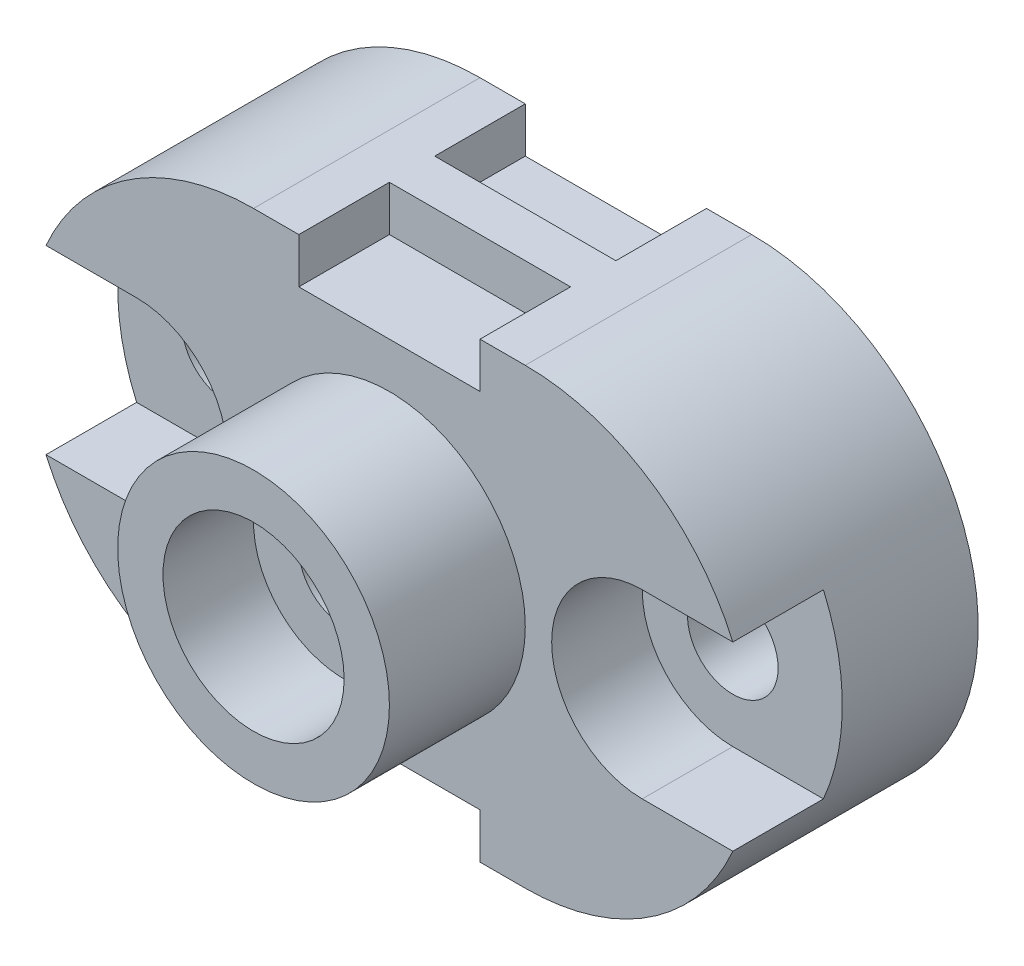
ISO-10303-21;
HEADER;
FILE_DESCRIPTION(('STEP AP214'),'2;1');
FILE_NAME('part.step','',(''),(''),'','','');
FILE_SCHEMA(('AUTOMOTIVE_DESIGN { 1 0 10303 214 1 1 1 1 }'));
ENDSEC;
DATA;
#1=APPLICATION_CONTEXT('core data for automotive mechanical design processes');
#2=APPLICATION_PROTOCOL_DEFINITION('international standard','automotive_design',2000,#1);
#3=PRODUCT_CONTEXT('',#1,'mechanical');
#4=PRODUCT('Part','Part','',(#3));
#5=PRODUCT_RELATED_PRODUCT_CATEGORY('part','',(#4));
#6=PRODUCT_DEFINITION_FORMATION('','',#4);
#7=PRODUCT_DEFINITION_CONTEXT('part definition',#1,'design');
#8=PRODUCT_DEFINITION('design','',#6,#7);
#9=PRODUCT_DEFINITION_SHAPE('','',#8);
#10=(LENGTH_UNIT() NAMED_UNIT(*) SI_UNIT(.MILLI.,.METRE.));
#11=(NAMED_UNIT(*) PLANE_ANGLE_UNIT() SI_UNIT($,.RADIAN.));
#12=(NAMED_UNIT(*) SI_UNIT($,.STERADIAN.) SOLID_ANGLE_UNIT());
#13=UNCERTAINTY_MEASURE_WITH_UNIT(LENGTH_MEASURE(1.E-05),#10,'distance_accuracy_value','');
#14=(GEOMETRIC_REPRESENTATION_CONTEXT(3) GLOBAL_UNCERTAINTY_ASSIGNED_CONTEXT((#13)) GLOBAL_UNIT_ASSIGNED_CONTEXT((#10,
#11,#12)) REPRESENTATION_CONTEXT('',''));
#15=CARTESIAN_POINT('',(0.,0.,0.));
#16=DIRECTION('',(0.,0.,1.));
#17=DIRECTION('',(1.,0.,0.));
#18=AXIS2_PLACEMENT_3D('',#15,#16,#17);
#19=CARTESIAN_POINT('',(-30.,-25.,25.));
#20=DIRECTION('',(0.,0.,1.));
#21=DIRECTION('',(1.,0.,0.));
#22=AXIS2_PLACEMENT_3D('',#19,#20,#21);
#23=PLANE('',#22);
#24=DIRECTION('',(-1.,0.,0.));
#25=VECTOR('',#24,1.);
#26=CARTESIAN_POINT('',(-52.9128784747792,-15.,25.));
#27=LINE('',#26,#25);
#28=CARTESIAN_POINT('',(-42.9128784747792,-15.,25.));
#29=VERTEX_POINT('',#28);
#30=CARTESIAN_POINT('',(-52.9128784747792,-15.,25.));
#31=VERTEX_POINT('',#30);
#32=EDGE_CURVE('E236',#29,#31,#27,.T.);
#33=ORIENTED_EDGE('',*,*,#32,.F.);
#34=CARTESIAN_POINT('',(-42.9128784747792,-25.,25.));
#35=DIRECTION('',(0.,0.,1.));
#36=DIRECTION('',(-1.,0.,0.));
#37=AXIS2_PLACEMENT_3D('',#34,#35,#36);
#38=CIRCLE('',#37,10.);
#39=CARTESIAN_POINT('',(-42.9128784747792,-35.,25.));
#40=VERTEX_POINT('',#39);
#41=EDGE_CURVE('E495',#40,#29,#38,.T.);
#42=ORIENTED_EDGE('',*,*,#41,.F.);
#43=DIRECTION('',(1.,0.,0.));
#44=VECTOR('',#43,1.);
#45=CARTESIAN_POINT('',(-52.9128784747792,-35.,25.));
#46=LINE('',#45,#44);
#47=CARTESIAN_POINT('',(-52.9128784747792,-35.,25.));
#48=VERTEX_POINT('',#47);
#49=EDGE_CURVE('E493',#48,#40,#46,.T.);
#50=ORIENTED_EDGE('',*,*,#49,.F.);
#51=CARTESIAN_POINT('',(-30.,-25.,25.));
#52=DIRECTION('',(0.,0.,1.));
#53=DIRECTION('',(1.,0.,0.));
#54=AXIS2_PLACEMENT_3D('',#51,#52,#53);
#55=CIRCLE('',#54,25.);
#56=CARTESIAN_POINT('',(-30.,-50.,25.));
#57=VERTEX_POINT('',#56);
#58=EDGE_CURVE('E240',#48,#57,#55,.T.);
#59=ORIENTED_EDGE('',*,*,#58,.T.);
#60=DIRECTION('',(1.,0.,0.));
#61=VECTOR('',#60,1.);
#62=CARTESIAN_POINT('',(-30.,-50.,25.));
#63=LINE('',#62,#61);
#64=CARTESIAN_POINT('',(-25.,-50.,25.));
#65=VERTEX_POINT('',#64);
#66=EDGE_CURVE('E412',#57,#65,#63,.T.);
#67=ORIENTED_EDGE('',*,*,#66,.T.);
#68=DIRECTION('',(0.,-1.,0.));
#69=VECTOR('',#68,1.);
#70=CARTESIAN_POINT('',(-25.,-50.,25.));
#71=LINE('',#70,#69);
#72=CARTESIAN_POINT('',(-25.,-45.,25.));
#73=VERTEX_POINT('',#72);
#74=EDGE_CURVE('E354',#73,#65,#71,.T.);
#75=ORIENTED_EDGE('',*,*,#74,.F.);
#76=DIRECTION('',(-1.,0.,0.));
#77=VECTOR('',#76,1.);
#78=CARTESIAN_POINT('',(-25.,-45.,25.));
#79=LINE('',#78,#77);
#80=CARTESIAN_POINT('',(-5.00000000000001,-45.,25.));
#81=VERTEX_POINT('',#80);
#82=EDGE_CURVE('E366',#81,#73,#79,.T.);
#83=ORIENTED_EDGE('',*,*,#82,.F.);
#84=DIRECTION('',(0.,1.,0.));
#85=VECTOR('',#84,1.);
#86=CARTESIAN_POINT('',(-5.00000000000001,-45.,25.));
#87=LINE('',#86,#85);
#88=CARTESIAN_POINT('',(-5.,-50.,25.));
#89=VERTEX_POINT('',#88);
#90=EDGE_CURVE('E344',#89,#81,#87,.T.);
#91=ORIENTED_EDGE('',*,*,#90,.F.);
#92=CARTESIAN_POINT('',(0.,-50.,25.));
#93=VERTEX_POINT('',#92);
#94=EDGE_CURVE('E411',#89,#93,#63,.T.);
#95=ORIENTED_EDGE('',*,*,#94,.T.);
#96=CARTESIAN_POINT('',(0.,-25.,25.));
#97=DIRECTION('',(0.,0.,1.));
#98=DIRECTION('',(1.,0.,0.));
#99=AXIS2_PLACEMENT_3D('',#96,#97,#98);
#100=CIRCLE('',#99,25.);
#101=CARTESIAN_POINT('',(22.9128784747793,-35.,25.));
#102=VERTEX_POINT('',#101);
#103=EDGE_CURVE('E416',#93,#102,#100,.T.);
#104=ORIENTED_EDGE('',*,*,#103,.T.);
#105=DIRECTION('',(1.,0.,0.));
#106=VECTOR('',#105,1.);
#107=CARTESIAN_POINT('',(22.9128784747793,-35.,25.));
#108=LINE('',#107,#106);
#109=CARTESIAN_POINT('',(12.9128784747793,-35.,25.));
#110=VERTEX_POINT('',#109);
#111=EDGE_CURVE('E250',#110,#102,#108,.T.);
#112=ORIENTED_EDGE('',*,*,#111,.F.);
#113=CARTESIAN_POINT('',(12.9128784747793,-25.,25.));
#114=DIRECTION('',(0.,0.,1.));
#115=DIRECTION('',(-1.,0.,0.));
#116=AXIS2_PLACEMENT_3D('',#113,#114,#115);
#117=CIRCLE('',#116,10.);
#118=CARTESIAN_POINT('',(12.9128784747793,-15.,25.));
#119=VERTEX_POINT('',#118);
#120=EDGE_CURVE('E260',#119,#110,#117,.T.);
#121=ORIENTED_EDGE('',*,*,#120,.F.);
#122=DIRECTION('',(-1.,0.,0.));
#123=VECTOR('',#122,1.);
#124=CARTESIAN_POINT('',(12.9128784747793,-15.,25.));
#125=LINE('',#124,#123);
#126=CARTESIAN_POINT('',(22.9128784747793,-15.,25.));
#127=VERTEX_POINT('',#126);
#128=EDGE_CURVE('E257',#127,#119,#125,.T.);
#129=ORIENTED_EDGE('',*,*,#128,.F.);
#130=CARTESIAN_POINT('',(0.,0.,25.));
#131=VERTEX_POINT('',#130);
#132=EDGE_CURVE('E415',#127,#131,#100,.T.);
#133=ORIENTED_EDGE('',*,*,#132,.T.);
#134=DIRECTION('',(-1.,0.,0.));
#135=VECTOR('',#134,1.);
#136=CARTESIAN_POINT('',(-30.,0.,25.));
#137=LINE('',#136,#135);
#138=CARTESIAN_POINT('',(-5.,0.,25.));
#139=VERTEX_POINT('',#138);
#140=EDGE_CURVE('E420',#131,#139,#137,.T.);
#141=ORIENTED_EDGE('',*,*,#140,.T.);
#142=DIRECTION('',(0.,1.,0.));
#143=VECTOR('',#142,1.);
#144=CARTESIAN_POINT('',(-5.,-5.,25.));
#145=LINE('',#144,#143);
#146=CARTESIAN_POINT('',(-5.,-5.,25.));
#147=VERTEX_POINT('',#146);
#148=EDGE_CURVE('E383',#147,#139,#145,.T.);
#149=ORIENTED_EDGE('',*,*,#148,.F.);
#150=DIRECTION('',(1.,0.,0.));
#151=VECTOR('',#150,1.);
#152=CARTESIAN_POINT('',(-25.,-5.,25.));
#153=LINE('',#152,#151);
#154=CARTESIAN_POINT('',(-25.,-5.,25.));
#155=VERTEX_POINT('',#154);
#156=EDGE_CURVE('E395',#155,#147,#153,.T.);
#157=ORIENTED_EDGE('',*,*,#156,.F.);
#158=DIRECTION('',(0.,-1.,0.));
#159=VECTOR('',#158,1.);
#160=CARTESIAN_POINT('',(-25.,0.,25.));
#161=LINE('',#160,#159);
#162=CARTESIAN_POINT('',(-25.,0.,25.));
#163=VERTEX_POINT('',#162);
#164=EDGE_CURVE('E373',#163,#155,#161,.T.);
#165=ORIENTED_EDGE('',*,*,#164,.F.);
#166=CARTESIAN_POINT('',(-30.,0.,25.));
#167=VERTEX_POINT('',#166);
#168=EDGE_CURVE('E419',#163,#167,#137,.T.);
#169=ORIENTED_EDGE('',*,*,#168,.T.);
#170=EDGE_CURVE('E408',#167,#31,#55,.T.);
#171=ORIENTED_EDGE('',*,*,#170,.T.);
#172=EDGE_LOOP('',(#33,#42,#50,#59,#67,#75,#83,#91,#95,#104,#112,#121,#129,#133,#141,#149,#157,
#165,#169,#171));
#173=FACE_BOUND('',#172,.T.);
#174=CARTESIAN_POINT('',(-15.,-25.,25.));
#175=DIRECTION('',(0.,0.,1.));
#176=DIRECTION('',(1.,0.,0.));
#177=AXIS2_PLACEMENT_3D('',#174,#175,#176);
#178=CIRCLE('',#177,15.);
#179=CARTESIAN_POINT('',(0.,-25.,25.));
#180=VERTEX_POINT('',#179);
#181=EDGE_CURVE('E283',#180,#180,#178,.T.);
#182=ORIENTED_EDGE('',*,*,#181,.F.);
#183=EDGE_LOOP('',(#182));
#184=FACE_BOUND('',#183,.T.);
#185=ADVANCED_FACE('F33',(#173,#184),#23,.T.);
#186=CARTESIAN_POINT('',(-30.,-25.,25.));
#187=DIRECTION('',(0.,0.,-1.));
#188=DIRECTION('',(-1.,0.,0.));
#189=AXIS2_PLACEMENT_3D('',#186,#187,#188);
#190=CYLINDRICAL_SURFACE('',#189,25.);
#191=CARTESIAN_POINT('',(-29.9999999999981,-24.9999999999999,15.));
#192=DIRECTION('',(0.,0.,1.));
#193=DIRECTION('',(-1.,0.,0.));
#194=AXIS2_PLACEMENT_3D('',#191,#192,#193);
#195=CIRCLE('',#194,25.0000000000017);
#196=CARTESIAN_POINT('',(-52.9128784747792,-15.,15.));
#197=VERTEX_POINT('',#196);
#198=CARTESIAN_POINT('',(-52.9128784747792,-35.,15.));
#199=VERTEX_POINT('',#198);
#200=EDGE_CURVE('E230',#197,#199,#195,.T.);
#201=ORIENTED_EDGE('',*,*,#200,.F.);
#202=DIRECTION('',(0.,0.,1.));
#203=VECTOR('',#202,1.);
#204=CARTESIAN_POINT('',(-52.9128784747792,-15.,15.));
#205=LINE('',#204,#203);
#206=EDGE_CURVE('E261',#197,#31,#205,.T.);
#207=ORIENTED_EDGE('',*,*,#206,.T.);
#208=ORIENTED_EDGE('',*,*,#170,.F.);
#209=DIRECTION('',(0.,0.,-1.));
#210=VECTOR('',#209,1.);
#211=CARTESIAN_POINT('',(-30.,0.,25.));
#212=LINE('',#211,#210);
#213=CARTESIAN_POINT('',(-30.,0.,0.));
#214=VERTEX_POINT('',#213);
#215=EDGE_CURVE('E423',#167,#214,#212,.T.);
#216=ORIENTED_EDGE('',*,*,#215,.T.);
#217=CARTESIAN_POINT('',(-30.,-25.,0.));
#218=DIRECTION('',(0.,0.,1.));
#219=DIRECTION('',(1.,0.,0.));
#220=AXIS2_PLACEMENT_3D('',#217,#218,#219);
#221=CIRCLE('',#220,25.);
#222=CARTESIAN_POINT('',(-30.,-50.,0.));
#223=VERTEX_POINT('',#222);
#224=EDGE_CURVE('E402',#214,#223,#221,.T.);
#225=ORIENTED_EDGE('',*,*,#224,.T.);
#226=DIRECTION('',(0.,0.,-1.));
#227=VECTOR('',#226,1.);
#228=CARTESIAN_POINT('',(-30.,-50.,25.));
#229=LINE('',#228,#227);
#230=EDGE_CURVE('E11',#57,#223,#229,.T.);
#231=ORIENTED_EDGE('',*,*,#230,.F.);
#232=ORIENTED_EDGE('',*,*,#58,.F.);
#233=DIRECTION('',(0.,0.,1.));
#234=VECTOR('',#233,1.);
#235=CARTESIAN_POINT('',(-52.9128784747792,-35.,15.));
#236=LINE('',#235,#234);
#237=EDGE_CURVE('E225',#199,#48,#236,.T.);
#238=ORIENTED_EDGE('',*,*,#237,.F.);
#239=EDGE_LOOP('',(#201,#207,#208,#216,#225,#231,#232,#238));
#240=FACE_BOUND('',#239,.T.);
#241=ADVANCED_FACE('F35',(#240),#190,.T.);
#242=CARTESIAN_POINT('',(-30.,-50.,25.));
#243=DIRECTION('',(0.,1.,0.));
#244=DIRECTION('',(0.,0.,1.));
#245=AXIS2_PLACEMENT_3D('',#242,#243,#244);
#246=PLANE('',#245);
#247=DIRECTION('',(-1.,0.,0.));
#248=VECTOR('',#247,1.);
#249=CARTESIAN_POINT('',(-25.,-50.,10.));
#250=LINE('',#249,#248);
#251=CARTESIAN_POINT('',(-5.,-50.,10.));
#252=VERTEX_POINT('',#251);
#253=CARTESIAN_POINT('',(-25.,-50.,10.));
#254=VERTEX_POINT('',#253);
#255=EDGE_CURVE('E292',#252,#254,#250,.T.);
#256=ORIENTED_EDGE('',*,*,#255,.F.);
#257=DIRECTION('',(0.,0.,-1.));
#258=VECTOR('',#257,1.);
#259=CARTESIAN_POINT('',(-5.,-50.,10.));
#260=LINE('',#259,#258);
#261=CARTESIAN_POINT('',(-5.,-50.,0.));
#262=VERTEX_POINT('',#261);
#263=EDGE_CURVE('E312',#252,#262,#260,.T.);
#264=ORIENTED_EDGE('',*,*,#263,.T.);
#265=DIRECTION('',(1.,0.,0.));
#266=VECTOR('',#265,1.);
#267=CARTESIAN_POINT('',(-30.,-50.,0.));
#268=LINE('',#267,#266);
#269=CARTESIAN_POINT('',(0.,-50.,0.));
#270=VERTEX_POINT('',#269);
#271=EDGE_CURVE('E426',#262,#270,#268,.T.);
#272=ORIENTED_EDGE('',*,*,#271,.T.);
#273=DIRECTION('',(0.,0.,-1.));
#274=VECTOR('',#273,1.);
#275=CARTESIAN_POINT('',(0.,-50.,25.));
#276=LINE('',#275,#274);
#277=EDGE_CURVE('E41',#93,#270,#276,.T.);
#278=ORIENTED_EDGE('',*,*,#277,.F.);
#279=ORIENTED_EDGE('',*,*,#94,.F.);
#280=DIRECTION('',(0.,0.,1.));
#281=VECTOR('',#280,1.);
#282=CARTESIAN_POINT('',(-5.,-50.,15.));
#283=LINE('',#282,#281);
#284=CARTESIAN_POINT('',(-5.,-50.,15.));
#285=VERTEX_POINT('',#284);
#286=EDGE_CURVE('E363',#285,#89,#283,.T.);
#287=ORIENTED_EDGE('',*,*,#286,.F.);
#288=DIRECTION('',(1.,0.,0.));
#289=VECTOR('',#288,1.);
#290=CARTESIAN_POINT('',(-5.,-50.,15.));
#291=LINE('',#290,#289);
#292=CARTESIAN_POINT('',(-25.,-50.,15.));
#293=VERTEX_POINT('',#292);
#294=EDGE_CURVE('E350',#293,#285,#291,.T.);
#295=ORIENTED_EDGE('',*,*,#294,.F.);
#296=DIRECTION('',(0.,0.,1.));
#297=VECTOR('',#296,1.);
#298=CARTESIAN_POINT('',(-25.,-50.,15.));
#299=LINE('',#298,#297);
#300=EDGE_CURVE('E370',#293,#65,#299,.T.);
#301=ORIENTED_EDGE('',*,*,#300,.T.);
#302=ORIENTED_EDGE('',*,*,#66,.F.);
#303=ORIENTED_EDGE('',*,*,#230,.T.);
#304=CARTESIAN_POINT('',(-25.,-50.,0.));
#305=VERTEX_POINT('',#304);
#306=EDGE_CURVE('E427',#223,#305,#268,.T.);
#307=ORIENTED_EDGE('',*,*,#306,.T.);
#308=DIRECTION('',(0.,0.,-1.));
#309=VECTOR('',#308,1.);
#310=CARTESIAN_POINT('',(-25.,-50.,10.));
#311=LINE('',#310,#309);
#312=EDGE_CURVE('E305',#254,#305,#311,.T.);
#313=ORIENTED_EDGE('',*,*,#312,.F.);
#314=EDGE_LOOP('',(#256,#264,#272,#278,#279,#287,#295,#301,#302,#303,#307,#313));
#315=FACE_BOUND('',#314,.T.);
#316=ADVANCED_FACE('F480',(#315),#246,.F.);
#317=CARTESIAN_POINT('',(0.,-25.,25.));
#318=DIRECTION('',(0.,0.,-1.));
#319=DIRECTION('',(-1.,0.,0.));
#320=AXIS2_PLACEMENT_3D('',#317,#318,#319);
#321=CYLINDRICAL_SURFACE('',#320,25.);
#322=CARTESIAN_POINT('',(-2.32452945780892E-13,-25.,15.));
#323=DIRECTION('',(0.,0.,1.));
#324=DIRECTION('',(1.,0.,0.));
#325=AXIS2_PLACEMENT_3D('',#322,#323,#324);
#326=CIRCLE('',#325,25.0000000000003);
#327=CARTESIAN_POINT('',(22.9128784747792,-35.,15.));
#328=VERTEX_POINT('',#327);
#329=CARTESIAN_POINT('',(22.9128784747793,-15.,15.));
#330=VERTEX_POINT('',#329);
#331=EDGE_CURVE('E247',#328,#330,#326,.T.);
#332=ORIENTED_EDGE('',*,*,#331,.F.);
#333=DIRECTION('',(0.,0.,1.));
#334=VECTOR('',#333,1.);
#335=CARTESIAN_POINT('',(22.9128784747793,-35.,15.));
#336=LINE('',#335,#334);
#337=EDGE_CURVE('E265',#328,#102,#336,.T.);
#338=ORIENTED_EDGE('',*,*,#337,.T.);
#339=ORIENTED_EDGE('',*,*,#103,.F.);
#340=ORIENTED_EDGE('',*,*,#277,.T.);
#341=CARTESIAN_POINT('',(0.,-25.,0.));
#342=DIRECTION('',(0.,0.,1.));
#343=DIRECTION('',(1.,0.,0.));
#344=AXIS2_PLACEMENT_3D('',#341,#342,#343);
#345=CIRCLE('',#344,25.);
#346=CARTESIAN_POINT('',(0.,0.,0.));
#347=VERTEX_POINT('',#346);
#348=EDGE_CURVE('E430',#270,#347,#345,.T.);
#349=ORIENTED_EDGE('',*,*,#348,.T.);
#350=DIRECTION('',(0.,0.,-1.));
#351=VECTOR('',#350,1.);
#352=CARTESIAN_POINT('',(0.,0.,25.));
#353=LINE('',#352,#351);
#354=EDGE_CURVE('E438',#131,#347,#353,.T.);
#355=ORIENTED_EDGE('',*,*,#354,.F.);
#356=ORIENTED_EDGE('',*,*,#132,.F.);
#357=DIRECTION('',(0.,0.,1.));
#358=VECTOR('',#357,1.);
#359=CARTESIAN_POINT('',(22.9128784747793,-15.,15.));
#360=LINE('',#359,#358);
#361=EDGE_CURVE('E256',#330,#127,#360,.T.);
#362=ORIENTED_EDGE('',*,*,#361,.F.);
#363=EDGE_LOOP('',(#332,#338,#339,#340,#349,#355,#356,#362));
#364=FACE_BOUND('',#363,.T.);
#365=ADVANCED_FACE('F446',(#364),#321,.T.);
#366=CARTESIAN_POINT('',(-30.,0.,25.));
#367=DIRECTION('',(0.,-1.,0.));
#368=DIRECTION('',(0.,0.,-1.));
#369=AXIS2_PLACEMENT_3D('',#366,#367,#368);
#370=PLANE('',#369);
#371=DIRECTION('',(1.,0.,0.));
#372=VECTOR('',#371,1.);
#373=CARTESIAN_POINT('',(-25.,0.,10.));
#374=LINE('',#373,#372);
#375=CARTESIAN_POINT('',(-25.,0.,10.));
#376=VERTEX_POINT('',#375);
#377=CARTESIAN_POINT('',(-5.,0.,10.));
#378=VERTEX_POINT('',#377);
#379=EDGE_CURVE('E321',#376,#378,#374,.T.);
#380=ORIENTED_EDGE('',*,*,#379,.F.);
#381=DIRECTION('',(0.,0.,-1.));
#382=VECTOR('',#381,1.);
#383=CARTESIAN_POINT('',(-25.,0.,10.));
#384=LINE('',#383,#382);
#385=CARTESIAN_POINT('',(-25.,0.,0.));
#386=VERTEX_POINT('',#385);
#387=EDGE_CURVE('E341',#376,#386,#384,.T.);
#388=ORIENTED_EDGE('',*,*,#387,.T.);
#389=DIRECTION('',(-1.,0.,0.));
#390=VECTOR('',#389,1.);
#391=CARTESIAN_POINT('',(-30.,0.,0.));
#392=LINE('',#391,#390);
#393=EDGE_CURVE('E432',#386,#214,#392,.T.);
#394=ORIENTED_EDGE('',*,*,#393,.T.);
#395=ORIENTED_EDGE('',*,*,#215,.F.);
#396=ORIENTED_EDGE('',*,*,#168,.F.);
#397=DIRECTION('',(0.,0.,1.));
#398=VECTOR('',#397,1.);
#399=CARTESIAN_POINT('',(-25.,0.,15.));
#400=LINE('',#399,#398);
#401=CARTESIAN_POINT('',(-25.,0.,15.));
#402=VERTEX_POINT('',#401);
#403=EDGE_CURVE('E392',#402,#163,#400,.T.);
#404=ORIENTED_EDGE('',*,*,#403,.F.);
#405=DIRECTION('',(-1.,0.,0.));
#406=VECTOR('',#405,1.);
#407=CARTESIAN_POINT('',(-5.,0.,15.));
#408=LINE('',#407,#406);
#409=CARTESIAN_POINT('',(-5.,0.,15.));
#410=VERTEX_POINT('',#409);
#411=EDGE_CURVE('E379',#410,#402,#408,.T.);
#412=ORIENTED_EDGE('',*,*,#411,.F.);
#413=DIRECTION('',(0.,0.,1.));
#414=VECTOR('',#413,1.);
#415=CARTESIAN_POINT('',(-5.,0.,15.));
#416=LINE('',#415,#414);
#417=EDGE_CURVE('E399',#410,#139,#416,.T.);
#418=ORIENTED_EDGE('',*,*,#417,.T.);
#419=ORIENTED_EDGE('',*,*,#140,.F.);
#420=ORIENTED_EDGE('',*,*,#354,.T.);
#421=CARTESIAN_POINT('',(-5.,0.,0.));
#422=VERTEX_POINT('',#421);
#423=EDGE_CURVE('E433',#347,#422,#392,.T.);
#424=ORIENTED_EDGE('',*,*,#423,.T.);
#425=DIRECTION('',(0.,0.,-1.));
#426=VECTOR('',#425,1.);
#427=CARTESIAN_POINT('',(-5.,0.,10.));
#428=LINE('',#427,#426);
#429=EDGE_CURVE('E334',#378,#422,#428,.T.);
#430=ORIENTED_EDGE('',*,*,#429,.F.);
#431=EDGE_LOOP('',(#380,#388,#394,#395,#396,#404,#412,#418,#419,#420,#424,#430));
#432=FACE_BOUND('',#431,.T.);
#433=ADVANCED_FACE('F460',(#432),#370,.F.);
#434=CARTESIAN_POINT('',(-30.,-25.,0.));
#435=DIRECTION('',(0.,0.,1.));
#436=DIRECTION('',(1.,0.,0.));
#437=AXIS2_PLACEMENT_3D('',#434,#435,#436);
#438=PLANE('',#437);
#439=CARTESIAN_POINT('',(12.9128784747793,-25.,0.));
#440=DIRECTION('',(0.,0.,1.));
#441=DIRECTION('',(1.,0.,0.));
#442=AXIS2_PLACEMENT_3D('',#439,#440,#441);
#443=CIRCLE('',#442,5.);
#444=CARTESIAN_POINT('',(17.9128784747793,-25.,0.));
#445=VERTEX_POINT('',#444);
#446=EDGE_CURVE('E867',#445,#445,#443,.T.);
#447=ORIENTED_EDGE('',*,*,#446,.T.);
#448=EDGE_LOOP('',(#447));
#449=FACE_BOUND('',#448,.T.);
#450=CARTESIAN_POINT('',(-42.9128784747792,-25.,0.));
#451=DIRECTION('',(0.,0.,1.));
#452=DIRECTION('',(1.,0.,0.));
#453=AXIS2_PLACEMENT_3D('',#450,#451,#452);
#454=CIRCLE('',#453,5.);
#455=CARTESIAN_POINT('',(-37.9128784747792,-25.,0.));
#456=VERTEX_POINT('',#455);
#457=EDGE_CURVE('E496',#456,#456,#454,.T.);
#458=ORIENTED_EDGE('',*,*,#457,.T.);
#459=EDGE_LOOP('',(#458));
#460=FACE_BOUND('',#459,.T.);
#461=CARTESIAN_POINT('',(-15.,-25.,0.));
#462=DIRECTION('',(0.,0.,1.));
#463=DIRECTION('',(1.,0.,0.));
#464=AXIS2_PLACEMENT_3D('',#461,#462,#463);
#465=CIRCLE('',#464,5.);
#466=CARTESIAN_POINT('',(-10.,-25.,0.));
#467=VERTEX_POINT('',#466);
#468=EDGE_CURVE('E276',#467,#467,#465,.T.);
#469=ORIENTED_EDGE('',*,*,#468,.T.);
#470=EDGE_LOOP('',(#469));
#471=FACE_BOUND('',#470,.T.);
#472=ORIENTED_EDGE('',*,*,#271,.F.);
#473=DIRECTION('',(0.,-1.,0.));
#474=VECTOR('',#473,1.);
#475=CARTESIAN_POINT('',(-5.,-50.,0.));
#476=LINE('',#475,#474);
#477=CARTESIAN_POINT('',(-5.00000000000001,-45.,0.));
#478=VERTEX_POINT('',#477);
#479=EDGE_CURVE('E296',#478,#262,#476,.T.);
#480=ORIENTED_EDGE('',*,*,#479,.F.);
#481=DIRECTION('',(1.,0.,0.));
#482=VECTOR('',#481,1.);
#483=CARTESIAN_POINT('',(-5.00000000000001,-45.,0.));
#484=LINE('',#483,#482);
#485=CARTESIAN_POINT('',(-25.,-45.,0.));
#486=VERTEX_POINT('',#485);
#487=EDGE_CURVE('E308',#486,#478,#484,.T.);
#488=ORIENTED_EDGE('',*,*,#487,.F.);
#489=DIRECTION('',(0.,1.,0.));
#490=VECTOR('',#489,1.);
#491=CARTESIAN_POINT('',(-25.,-45.,0.));
#492=LINE('',#491,#490);
#493=EDGE_CURVE('E289',#305,#486,#492,.T.);
#494=ORIENTED_EDGE('',*,*,#493,.F.);
#495=ORIENTED_EDGE('',*,*,#306,.F.);
#496=ORIENTED_EDGE('',*,*,#224,.F.);
#497=ORIENTED_EDGE('',*,*,#393,.F.);
#498=DIRECTION('',(0.,1.,0.));
#499=VECTOR('',#498,1.);
#500=CARTESIAN_POINT('',(-25.,-5.,0.));
#501=LINE('',#500,#499);
#502=CARTESIAN_POINT('',(-25.,-5.,0.));
#503=VERTEX_POINT('',#502);
#504=EDGE_CURVE('E325',#503,#386,#501,.T.);
#505=ORIENTED_EDGE('',*,*,#504,.F.);
#506=DIRECTION('',(-1.,0.,0.));
#507=VECTOR('',#506,1.);
#508=CARTESIAN_POINT('',(-5.,-5.,0.));
#509=LINE('',#508,#507);
#510=CARTESIAN_POINT('',(-5.,-5.,0.));
#511=VERTEX_POINT('',#510);
#512=EDGE_CURVE('E337',#511,#503,#509,.T.);
#513=ORIENTED_EDGE('',*,*,#512,.F.);
#514=DIRECTION('',(0.,-1.,0.));
#515=VECTOR('',#514,1.);
#516=CARTESIAN_POINT('',(-5.,0.,0.));
#517=LINE('',#516,#515);
#518=EDGE_CURVE('E315',#422,#511,#517,.T.);
#519=ORIENTED_EDGE('',*,*,#518,.F.);
#520=ORIENTED_EDGE('',*,*,#423,.F.);
#521=ORIENTED_EDGE('',*,*,#348,.F.);
#522=EDGE_LOOP('',(#472,#480,#488,#494,#495,#496,#497,#505,#513,#519,#520,#521));
#523=FACE_BOUND('',#522,.T.);
#524=ADVANCED_FACE('F453',(#449,#460,#471,#523),#438,.F.);
#525=CARTESIAN_POINT('',(-5.,-5.,15.));
#526=DIRECTION('',(1.,0.,0.));
#527=DIRECTION('',(0.,0.,-1.));
#528=AXIS2_PLACEMENT_3D('',#525,#526,#527);
#529=PLANE('',#528);
#530=ORIENTED_EDGE('',*,*,#148,.T.);
#531=ORIENTED_EDGE('',*,*,#417,.F.);
#532=DIRECTION('',(0.,1.,0.));
#533=VECTOR('',#532,1.);
#534=CARTESIAN_POINT('',(-5.,-5.,15.));
#535=LINE('',#534,#533);
#536=CARTESIAN_POINT('',(-5.,-5.,15.));
#537=VERTEX_POINT('',#536);
#538=EDGE_CURVE('E389',#537,#410,#535,.T.);
#539=ORIENTED_EDGE('',*,*,#538,.F.);
#540=DIRECTION('',(0.,0.,1.));
#541=VECTOR('',#540,1.);
#542=CARTESIAN_POINT('',(-5.,-5.,15.));
#543=LINE('',#542,#541);
#544=EDGE_CURVE('E403',#537,#147,#543,.T.);
#545=ORIENTED_EDGE('',*,*,#544,.T.);
#546=EDGE_LOOP('',(#530,#531,#539,#545));
#547=FACE_BOUND('',#546,.T.);
#548=ADVANCED_FACE('F549',(#547),#529,.F.);
#549=CARTESIAN_POINT('',(-25.,-5.,15.));
#550=DIRECTION('',(0.,-1.,0.));
#551=DIRECTION('',(0.,0.,-1.));
#552=AXIS2_PLACEMENT_3D('',#549,#550,#551);
#553=PLANE('',#552);
#554=ORIENTED_EDGE('',*,*,#156,.T.);
#555=ORIENTED_EDGE('',*,*,#544,.F.);
#556=DIRECTION('',(1.,0.,0.));
#557=VECTOR('',#556,1.);
#558=CARTESIAN_POINT('',(-25.,-5.,15.));
#559=LINE('',#558,#557);
#560=CARTESIAN_POINT('',(-25.,-5.,15.));
#561=VERTEX_POINT('',#560);
#562=EDGE_CURVE('E386',#561,#537,#559,.T.);
#563=ORIENTED_EDGE('',*,*,#562,.F.);
#564=DIRECTION('',(0.,0.,1.));
#565=VECTOR('',#564,1.);
#566=CARTESIAN_POINT('',(-25.,-5.,15.));
#567=LINE('',#566,#565);
#568=EDGE_CURVE('E405',#561,#155,#567,.T.);
#569=ORIENTED_EDGE('',*,*,#568,.T.);
#570=EDGE_LOOP('',(#554,#555,#563,#569));
#571=FACE_BOUND('',#570,.T.);
#572=ADVANCED_FACE('F582',(#571),#553,.F.);
#573=CARTESIAN_POINT('',(-25.,0.,15.));
#574=DIRECTION('',(-1.,0.,0.));
#575=DIRECTION('',(0.,0.,1.));
#576=AXIS2_PLACEMENT_3D('',#573,#574,#575);
#577=PLANE('',#576);
#578=ORIENTED_EDGE('',*,*,#164,.T.);
#579=ORIENTED_EDGE('',*,*,#568,.F.);
#580=DIRECTION('',(0.,-1.,0.));
#581=VECTOR('',#580,1.);
#582=CARTESIAN_POINT('',(-25.,0.,15.));
#583=LINE('',#582,#581);
#584=EDGE_CURVE('E382',#402,#561,#583,.T.);
#585=ORIENTED_EDGE('',*,*,#584,.F.);
#586=ORIENTED_EDGE('',*,*,#403,.T.);
#587=EDGE_LOOP('',(#578,#579,#585,#586));
#588=FACE_BOUND('',#587,.T.);
#589=ADVANCED_FACE('F545',(#588),#577,.F.);
#590=CARTESIAN_POINT('',(0.,0.,15.));
#591=DIRECTION('',(0.,0.,1.));
#592=DIRECTION('',(1.,0.,0.));
#593=AXIS2_PLACEMENT_3D('',#590,#591,#592);
#594=PLANE('',#593);
#595=ORIENTED_EDGE('',*,*,#411,.T.);
#596=ORIENTED_EDGE('',*,*,#584,.T.);
#597=ORIENTED_EDGE('',*,*,#562,.T.);
#598=ORIENTED_EDGE('',*,*,#538,.T.);
#599=EDGE_LOOP('',(#595,#596,#597,#598));
#600=FACE_BOUND('',#599,.T.);
#601=ADVANCED_FACE('F596',(#600),#594,.T.);
#602=CARTESIAN_POINT('',(-25.,-50.,15.));
#603=DIRECTION('',(-1.,0.,0.));
#604=DIRECTION('',(0.,-1.,0.));
#605=AXIS2_PLACEMENT_3D('',#602,#603,#604);
#606=PLANE('',#605);
#607=ORIENTED_EDGE('',*,*,#74,.T.);
#608=ORIENTED_EDGE('',*,*,#300,.F.);
#609=DIRECTION('',(0.,-1.,0.));
#610=VECTOR('',#609,1.);
#611=CARTESIAN_POINT('',(-25.,-50.,15.));
#612=LINE('',#611,#610);
#613=CARTESIAN_POINT('',(-25.,-45.,15.));
#614=VERTEX_POINT('',#613);
#615=EDGE_CURVE('E360',#614,#293,#612,.T.);
#616=ORIENTED_EDGE('',*,*,#615,.F.);
#617=DIRECTION('',(0.,0.,1.));
#618=VECTOR('',#617,1.);
#619=CARTESIAN_POINT('',(-25.,-45.,15.));
#620=LINE('',#619,#618);
#621=EDGE_CURVE('E374',#614,#73,#620,.T.);
#622=ORIENTED_EDGE('',*,*,#621,.T.);
#623=EDGE_LOOP('',(#607,#608,#616,#622));
#624=FACE_BOUND('',#623,.T.);
#625=ADVANCED_FACE('F489',(#624),#606,.F.);
#626=CARTESIAN_POINT('',(-25.,-45.,15.));
#627=DIRECTION('',(0.,1.,0.));
#628=DIRECTION('',(0.,0.,1.));
#629=AXIS2_PLACEMENT_3D('',#626,#627,#628);
#630=PLANE('',#629);
#631=ORIENTED_EDGE('',*,*,#82,.T.);
#632=ORIENTED_EDGE('',*,*,#621,.F.);
#633=DIRECTION('',(-1.,0.,0.));
#634=VECTOR('',#633,1.);
#635=CARTESIAN_POINT('',(-25.,-45.,15.));
#636=LINE('',#635,#634);
#637=CARTESIAN_POINT('',(-5.00000000000001,-45.,15.));
#638=VERTEX_POINT('',#637);
#639=EDGE_CURVE('E357',#638,#614,#636,.T.);
#640=ORIENTED_EDGE('',*,*,#639,.F.);
#641=DIRECTION('',(0.,0.,1.));
#642=VECTOR('',#641,1.);
#643=CARTESIAN_POINT('',(-5.00000000000001,-45.,15.));
#644=LINE('',#643,#642);
#645=EDGE_CURVE('E376',#638,#81,#644,.T.);
#646=ORIENTED_EDGE('',*,*,#645,.T.);
#647=EDGE_LOOP('',(#631,#632,#640,#646));
#648=FACE_BOUND('',#647,.T.);
#649=ADVANCED_FACE('F610',(#648),#630,.F.);
#650=CARTESIAN_POINT('',(-5.00000000000001,-45.,15.));
#651=DIRECTION('',(1.,0.,0.));
#652=DIRECTION('',(0.,1.,0.));
#653=AXIS2_PLACEMENT_3D('',#650,#651,#652);
#654=PLANE('',#653);
#655=ORIENTED_EDGE('',*,*,#90,.T.);
#656=ORIENTED_EDGE('',*,*,#645,.F.);
#657=DIRECTION('',(0.,1.,0.));
#658=VECTOR('',#657,1.);
#659=CARTESIAN_POINT('',(-5.00000000000001,-45.,15.));
#660=LINE('',#659,#658);
#661=EDGE_CURVE('E353',#285,#638,#660,.T.);
#662=ORIENTED_EDGE('',*,*,#661,.F.);
#663=ORIENTED_EDGE('',*,*,#286,.T.);
#664=EDGE_LOOP('',(#655,#656,#662,#663));
#665=FACE_BOUND('',#664,.T.);
#666=ADVANCED_FACE('F483',(#665),#654,.F.);
#667=CARTESIAN_POINT('',(0.,0.,15.));
#668=DIRECTION('',(0.,0.,-1.));
#669=DIRECTION('',(-1.,0.,0.));
#670=AXIS2_PLACEMENT_3D('',#667,#668,#669);
#671=PLANE('',#670);
#672=ORIENTED_EDGE('',*,*,#294,.T.);
#673=ORIENTED_EDGE('',*,*,#661,.T.);
#674=ORIENTED_EDGE('',*,*,#639,.T.);
#675=ORIENTED_EDGE('',*,*,#615,.T.);
#676=EDGE_LOOP('',(#672,#673,#674,#675));
#677=FACE_BOUND('',#676,.T.);
#678=ADVANCED_FACE('F486',(#677),#671,.F.);
#679=CARTESIAN_POINT('',(-25.,-5.,10.));
#680=DIRECTION('',(-1.,0.,0.));
#681=DIRECTION('',(0.,0.,1.));
#682=AXIS2_PLACEMENT_3D('',#679,#680,#681);
#683=PLANE('',#682);
#684=ORIENTED_EDGE('',*,*,#504,.T.);
#685=ORIENTED_EDGE('',*,*,#387,.F.);
#686=DIRECTION('',(0.,1.,0.));
#687=VECTOR('',#686,1.);
#688=CARTESIAN_POINT('',(-25.,-5.,10.));
#689=LINE('',#688,#687);
#690=CARTESIAN_POINT('',(-25.,-5.,10.));
#691=VERTEX_POINT('',#690);
#692=EDGE_CURVE('E331',#691,#376,#689,.T.);
#693=ORIENTED_EDGE('',*,*,#692,.F.);
#694=DIRECTION('',(0.,0.,-1.));
#695=VECTOR('',#694,1.);
#696=CARTESIAN_POINT('',(-25.,-5.,10.));
#697=LINE('',#696,#695);
#698=EDGE_CURVE('E345',#691,#503,#697,.T.);
#699=ORIENTED_EDGE('',*,*,#698,.T.);
#700=EDGE_LOOP('',(#684,#685,#693,#699));
#701=FACE_BOUND('',#700,.T.);
#702=ADVANCED_FACE('F629',(#701),#683,.F.);
#703=CARTESIAN_POINT('',(-5.,-5.,10.));
#704=DIRECTION('',(0.,-1.,0.));
#705=DIRECTION('',(0.,0.,-1.));
#706=AXIS2_PLACEMENT_3D('',#703,#704,#705);
#707=PLANE('',#706);
#708=ORIENTED_EDGE('',*,*,#512,.T.);
#709=ORIENTED_EDGE('',*,*,#698,.F.);
#710=DIRECTION('',(-1.,0.,0.));
#711=VECTOR('',#710,1.);
#712=CARTESIAN_POINT('',(-5.,-5.,10.));
#713=LINE('',#712,#711);
#714=CARTESIAN_POINT('',(-5.,-5.,10.));
#715=VERTEX_POINT('',#714);
#716=EDGE_CURVE('E328',#715,#691,#713,.T.);
#717=ORIENTED_EDGE('',*,*,#716,.F.);
#718=DIRECTION('',(0.,0.,-1.));
#719=VECTOR('',#718,1.);
#720=CARTESIAN_POINT('',(-5.,-5.,10.));
#721=LINE('',#720,#719);
#722=EDGE_CURVE('E347',#715,#511,#721,.T.);
#723=ORIENTED_EDGE('',*,*,#722,.T.);
#724=EDGE_LOOP('',(#708,#709,#717,#723));
#725=FACE_BOUND('',#724,.T.);
#726=ADVANCED_FACE('F635',(#725),#707,.F.);
#727=CARTESIAN_POINT('',(-5.,0.,10.));
#728=DIRECTION('',(1.,0.,0.));
#729=DIRECTION('',(0.,1.,0.));
#730=AXIS2_PLACEMENT_3D('',#727,#728,#729);
#731=PLANE('',#730);
#732=ORIENTED_EDGE('',*,*,#518,.T.);
#733=ORIENTED_EDGE('',*,*,#722,.F.);
#734=DIRECTION('',(0.,-1.,0.));
#735=VECTOR('',#734,1.);
#736=CARTESIAN_POINT('',(-5.,0.,10.));
#737=LINE('',#736,#735);
#738=EDGE_CURVE('E324',#378,#715,#737,.T.);
#739=ORIENTED_EDGE('',*,*,#738,.F.);
#740=ORIENTED_EDGE('',*,*,#429,.T.);
#741=EDGE_LOOP('',(#732,#733,#739,#740));
#742=FACE_BOUND('',#741,.T.);
#743=ADVANCED_FACE('F643',(#742),#731,.F.);
#744=CARTESIAN_POINT('',(0.,0.,10.));
#745=DIRECTION('',(0.,0.,-1.));
#746=DIRECTION('',(-1.,0.,0.));
#747=AXIS2_PLACEMENT_3D('',#744,#745,#746);
#748=PLANE('',#747);
#749=ORIENTED_EDGE('',*,*,#379,.T.);
#750=ORIENTED_EDGE('',*,*,#738,.T.);
#751=ORIENTED_EDGE('',*,*,#716,.T.);
#752=ORIENTED_EDGE('',*,*,#692,.T.);
#753=EDGE_LOOP('',(#749,#750,#751,#752));
#754=FACE_BOUND('',#753,.T.);
#755=ADVANCED_FACE('F536',(#754),#748,.T.);
#756=CARTESIAN_POINT('',(-5.,-50.,10.));
#757=DIRECTION('',(1.,0.,0.));
#758=DIRECTION('',(0.,1.,0.));
#759=AXIS2_PLACEMENT_3D('',#756,#757,#758);
#760=PLANE('',#759);
#761=ORIENTED_EDGE('',*,*,#479,.T.);
#762=ORIENTED_EDGE('',*,*,#263,.F.);
#763=DIRECTION('',(0.,-1.,0.));
#764=VECTOR('',#763,1.);
#765=CARTESIAN_POINT('',(-5.,-50.,10.));
#766=LINE('',#765,#764);
#767=CARTESIAN_POINT('',(-5.00000000000001,-45.,10.));
#768=VERTEX_POINT('',#767);
#769=EDGE_CURVE('E302',#768,#252,#766,.T.);
#770=ORIENTED_EDGE('',*,*,#769,.F.);
#771=DIRECTION('',(0.,0.,-1.));
#772=VECTOR('',#771,1.);
#773=CARTESIAN_POINT('',(-5.00000000000001,-45.,10.));
#774=LINE('',#773,#772);
#775=EDGE_CURVE('E316',#768,#478,#774,.T.);
#776=ORIENTED_EDGE('',*,*,#775,.T.);
#777=EDGE_LOOP('',(#761,#762,#770,#776));
#778=FACE_BOUND('',#777,.T.);
#779=ADVANCED_FACE('F526',(#778),#760,.F.);
#780=CARTESIAN_POINT('',(-5.00000000000001,-45.,10.));
#781=DIRECTION('',(0.,1.,0.));
#782=DIRECTION('',(0.,0.,1.));
#783=AXIS2_PLACEMENT_3D('',#780,#781,#782);
#784=PLANE('',#783);
#785=ORIENTED_EDGE('',*,*,#487,.T.);
#786=ORIENTED_EDGE('',*,*,#775,.F.);
#787=DIRECTION('',(1.,0.,0.));
#788=VECTOR('',#787,1.);
#789=CARTESIAN_POINT('',(-5.00000000000001,-45.,10.));
#790=LINE('',#789,#788);
#791=CARTESIAN_POINT('',(-25.,-45.,10.));
#792=VERTEX_POINT('',#791);
#793=EDGE_CURVE('E299',#792,#768,#790,.T.);
#794=ORIENTED_EDGE('',*,*,#793,.F.);
#795=DIRECTION('',(0.,0.,-1.));
#796=VECTOR('',#795,1.);
#797=CARTESIAN_POINT('',(-25.,-45.,10.));
#798=LINE('',#797,#796);
#799=EDGE_CURVE('E318',#792,#486,#798,.T.);
#800=ORIENTED_EDGE('',*,*,#799,.T.);
#801=EDGE_LOOP('',(#785,#786,#794,#800));
#802=FACE_BOUND('',#801,.T.);
#803=ADVANCED_FACE('F528',(#802),#784,.F.);
#804=CARTESIAN_POINT('',(-25.,-45.,10.));
#805=DIRECTION('',(-1.,0.,0.));
#806=DIRECTION('',(0.,-1.,0.));
#807=AXIS2_PLACEMENT_3D('',#804,#805,#806);
#808=PLANE('',#807);
#809=ORIENTED_EDGE('',*,*,#493,.T.);
#810=ORIENTED_EDGE('',*,*,#799,.F.);
#811=DIRECTION('',(0.,1.,0.));
#812=VECTOR('',#811,1.);
#813=CARTESIAN_POINT('',(-25.,-45.,10.));
#814=LINE('',#813,#812);
#815=EDGE_CURVE('E295',#254,#792,#814,.T.);
#816=ORIENTED_EDGE('',*,*,#815,.F.);
#817=ORIENTED_EDGE('',*,*,#312,.T.);
#818=EDGE_LOOP('',(#809,#810,#816,#817));
#819=FACE_BOUND('',#818,.T.);
#820=ADVANCED_FACE('F520',(#819),#808,.F.);
#821=CARTESIAN_POINT('',(0.,0.,10.));
#822=DIRECTION('',(0.,0.,1.));
#823=DIRECTION('',(1.,0.,0.));
#824=AXIS2_PLACEMENT_3D('',#821,#822,#823);
#825=PLANE('',#824);
#826=ORIENTED_EDGE('',*,*,#255,.T.);
#827=ORIENTED_EDGE('',*,*,#815,.T.);
#828=ORIENTED_EDGE('',*,*,#793,.T.);
#829=ORIENTED_EDGE('',*,*,#769,.T.);
#830=EDGE_LOOP('',(#826,#827,#828,#829));
#831=FACE_BOUND('',#830,.T.);
#832=ADVANCED_FACE('F523',(#831),#825,.F.);
#833=CARTESIAN_POINT('',(-15.,-25.,40.));
#834=DIRECTION('',(0.,0.,-1.));
#835=DIRECTION('',(-1.,0.,0.));
#836=AXIS2_PLACEMENT_3D('',#833,#834,#835);
#837=CYLINDRICAL_SURFACE('',#836,15.);
#838=CARTESIAN_POINT('',(-15.,-25.,40.));
#839=DIRECTION('',(0.,0.,1.));
#840=DIRECTION('',(1.,0.,0.));
#841=AXIS2_PLACEMENT_3D('',#838,#839,#840);
#842=CIRCLE('',#841,15.);
#843=CARTESIAN_POINT('',(0.,-25.,40.));
#844=VERTEX_POINT('',#843);
#845=EDGE_CURVE('E286',#844,#844,#842,.T.);
#846=ORIENTED_EDGE('',*,*,#845,.F.);
#847=EDGE_LOOP('',(#846));
#848=FACE_BOUND('',#847,.T.);
#849=ORIENTED_EDGE('',*,*,#181,.T.);
#850=EDGE_LOOP('',(#849));
#851=FACE_BOUND('',#850,.T.);
#852=ADVANCED_FACE('F682',(#848,#851),#837,.T.);
#853=CARTESIAN_POINT('',(-15.,-25.,40.));
#854=DIRECTION('',(0.,0.,1.));
#855=DIRECTION('',(1.,0.,0.));
#856=AXIS2_PLACEMENT_3D('',#853,#854,#855);
#857=PLANE('',#856);
#858=CARTESIAN_POINT('',(-15.,-25.,40.));
#859=DIRECTION('',(0.,0.,1.));
#860=DIRECTION('',(1.,0.,0.));
#861=AXIS2_PLACEMENT_3D('',#858,#859,#860);
#862=CIRCLE('',#861,10.);
#863=CARTESIAN_POINT('',(-5.00000000000001,-25.,40.));
#864=VERTEX_POINT('',#863);
#865=EDGE_CURVE('E279',#864,#864,#862,.T.);
#866=ORIENTED_EDGE('',*,*,#865,.F.);
#867=EDGE_LOOP('',(#866));
#868=FACE_BOUND('',#867,.T.);
#869=ORIENTED_EDGE('',*,*,#845,.T.);
#870=EDGE_LOOP('',(#869));
#871=FACE_BOUND('',#870,.T.);
#872=ADVANCED_FACE('F692',(#868,#871),#857,.T.);
#873=CARTESIAN_POINT('',(-15.,-25.,30.));
#874=DIRECTION('',(0.,0.,1.));
#875=DIRECTION('',(1.,0.,0.));
#876=AXIS2_PLACEMENT_3D('',#873,#874,#875);
#877=CYLINDRICAL_SURFACE('',#876,10.);
#878=CARTESIAN_POINT('',(-15.,-25.,30.));
#879=DIRECTION('',(0.,0.,1.));
#880=DIRECTION('',(1.,0.,0.));
#881=AXIS2_PLACEMENT_3D('',#878,#879,#880);
#882=CIRCLE('',#881,10.);
#883=CARTESIAN_POINT('',(-5.00000000000001,-25.,30.));
#884=VERTEX_POINT('',#883);
#885=EDGE_CURVE('E280',#884,#884,#882,.T.);
#886=ORIENTED_EDGE('',*,*,#885,.F.);
#887=EDGE_LOOP('',(#886));
#888=FACE_BOUND('',#887,.T.);
#889=ORIENTED_EDGE('',*,*,#865,.T.);
#890=EDGE_LOOP('',(#889));
#891=FACE_BOUND('',#890,.T.);
#892=ADVANCED_FACE('F702',(#888,#891),#877,.F.);
#893=CARTESIAN_POINT('',(-15.,-25.,30.));
#894=DIRECTION('',(0.,0.,1.));
#895=DIRECTION('',(1.,0.,0.));
#896=AXIS2_PLACEMENT_3D('',#893,#894,#895);
#897=PLANE('',#896);
#898=CARTESIAN_POINT('',(-15.,-25.,30.));
#899=DIRECTION('',(0.,0.,1.));
#900=DIRECTION('',(1.,0.,0.));
#901=AXIS2_PLACEMENT_3D('',#898,#899,#900);
#902=CIRCLE('',#901,5.);
#903=CARTESIAN_POINT('',(-10.,-25.,30.));
#904=VERTEX_POINT('',#903);
#905=EDGE_CURVE('E268',#904,#904,#902,.T.);
#906=ORIENTED_EDGE('',*,*,#905,.F.);
#907=EDGE_LOOP('',(#906));
#908=FACE_BOUND('',#907,.T.);
#909=ORIENTED_EDGE('',*,*,#885,.T.);
#910=EDGE_LOOP('',(#909));
#911=FACE_BOUND('',#910,.T.);
#912=ADVANCED_FACE('F712',(#908,#911),#897,.T.);
#913=CARTESIAN_POINT('',(-15.,-25.,-270.));
#914=DIRECTION('',(0.,0.,1.));
#915=DIRECTION('',(1.,0.,0.));
#916=AXIS2_PLACEMENT_3D('',#913,#914,#915);
#917=CYLINDRICAL_SURFACE('',#916,5.);
#918=ORIENTED_EDGE('',*,*,#905,.T.);
#919=EDGE_LOOP('',(#918));
#920=FACE_BOUND('',#919,.T.);
#921=ORIENTED_EDGE('',*,*,#468,.F.);
#922=EDGE_LOOP('',(#921));
#923=FACE_BOUND('',#922,.T.);
#924=ADVANCED_FACE('F722',(#920,#923),#917,.F.);
#925=CARTESIAN_POINT('',(22.9128784747793,-35.,15.));
#926=DIRECTION('',(0.,-1.,0.));
#927=DIRECTION('',(0.,0.,-1.));
#928=AXIS2_PLACEMENT_3D('',#925,#926,#927);
#929=PLANE('',#928);
#930=ORIENTED_EDGE('',*,*,#111,.T.);
#931=ORIENTED_EDGE('',*,*,#337,.F.);
#932=DIRECTION('',(1.,0.,0.));
#933=VECTOR('',#932,1.);
#934=CARTESIAN_POINT('',(22.9128784747793,-35.,15.));
#935=LINE('',#934,#933);
#936=CARTESIAN_POINT('',(12.9128784747793,-35.,15.));
#937=VERTEX_POINT('',#936);
#938=EDGE_CURVE('E56',#937,#328,#935,.T.);
#939=ORIENTED_EDGE('',*,*,#938,.F.);
#940=DIRECTION('',(0.,0.,1.));
#941=VECTOR('',#940,1.);
#942=CARTESIAN_POINT('',(12.9128784747793,-35.,15.));
#943=LINE('',#942,#941);
#944=EDGE_CURVE('E269',#937,#110,#943,.T.);
#945=ORIENTED_EDGE('',*,*,#944,.T.);
#946=EDGE_LOOP('',(#930,#931,#939,#945));
#947=FACE_BOUND('',#946,.T.);
#948=ADVANCED_FACE('F731',(#947),#929,.F.);
#949=CARTESIAN_POINT('',(12.9128784747793,-25.,15.));
#950=DIRECTION('',(0.,0.,1.));
#951=DIRECTION('',(1.,0.,0.));
#952=AXIS2_PLACEMENT_3D('',#949,#950,#951);
#953=CYLINDRICAL_SURFACE('',#952,10.);
#954=ORIENTED_EDGE('',*,*,#120,.T.);
#955=ORIENTED_EDGE('',*,*,#944,.F.);
#956=CARTESIAN_POINT('',(12.9128784747793,-25.,15.));
#957=DIRECTION('',(0.,0.,1.));
#958=DIRECTION('',(-1.,0.,0.));
#959=AXIS2_PLACEMENT_3D('',#956,#957,#958);
#960=CIRCLE('',#959,10.);
#961=CARTESIAN_POINT('',(12.9128784747793,-15.,15.));
#962=VERTEX_POINT('',#961);
#963=EDGE_CURVE('E253',#962,#937,#960,.T.);
#964=ORIENTED_EDGE('',*,*,#963,.F.);
#965=DIRECTION('',(0.,0.,1.));
#966=VECTOR('',#965,1.);
#967=CARTESIAN_POINT('',(12.9128784747793,-15.,15.));
#968=LINE('',#967,#966);
#969=EDGE_CURVE('E271',#962,#119,#968,.T.);
#970=ORIENTED_EDGE('',*,*,#969,.T.);
#971=EDGE_LOOP('',(#954,#955,#964,#970));
#972=FACE_BOUND('',#971,.T.);
#973=ADVANCED_FACE('F780',(#972),#953,.F.);
#974=CARTESIAN_POINT('',(12.9128784747793,-15.,15.));
#975=DIRECTION('',(0.,1.,0.));
#976=DIRECTION('',(-1.,0.,0.));
#977=AXIS2_PLACEMENT_3D('',#974,#975,#976);
#978=PLANE('',#977);
#979=ORIENTED_EDGE('',*,*,#128,.T.);
#980=ORIENTED_EDGE('',*,*,#969,.F.);
#981=DIRECTION('',(-1.,0.,0.));
#982=VECTOR('',#981,1.);
#983=CARTESIAN_POINT('',(12.9128784747793,-15.,15.));
#984=LINE('',#983,#982);
#985=EDGE_CURVE('E249',#330,#962,#984,.T.);
#986=ORIENTED_EDGE('',*,*,#985,.F.);
#987=ORIENTED_EDGE('',*,*,#361,.T.);
#988=EDGE_LOOP('',(#979,#980,#986,#987));
#989=FACE_BOUND('',#988,.T.);
#990=ADVANCED_FACE('F472',(#989),#978,.F.);
#991=CARTESIAN_POINT('',(-2.32452945780892E-13,-25.,15.));
#992=DIRECTION('',(0.,0.,1.));
#993=DIRECTION('',(1.,0.,0.));
#994=AXIS2_PLACEMENT_3D('',#991,#992,#993);
#995=PLANE('',#994);
#996=CARTESIAN_POINT('',(12.9128784747793,-25.,15.));
#997=DIRECTION('',(0.,0.,1.));
#998=DIRECTION('',(1.,0.,0.));
#999=AXIS2_PLACEMENT_3D('',#996,#997,#998);
#1000=CIRCLE('',#999,5.);
#1001=CARTESIAN_POINT('',(17.9128784747793,-25.,15.));
#1002=VERTEX_POINT('',#1001);
#1003=EDGE_CURVE('E864',#1002,#1002,#1000,.T.);
#1004=ORIENTED_EDGE('',*,*,#1003,.F.);
#1005=EDGE_LOOP('',(#1004));
#1006=FACE_BOUND('',#1005,.T.);
#1007=ORIENTED_EDGE('',*,*,#331,.T.);
#1008=ORIENTED_EDGE('',*,*,#985,.T.);
#1009=ORIENTED_EDGE('',*,*,#963,.T.);
#1010=ORIENTED_EDGE('',*,*,#938,.T.);
#1011=EDGE_LOOP('',(#1007,#1008,#1009,#1010));
#1012=FACE_BOUND('',#1011,.T.);
#1013=ADVANCED_FACE('F474',(#1006,#1012),#995,.T.);
#1014=CARTESIAN_POINT('',(-52.9128784747792,-15.,15.));
#1015=DIRECTION('',(0.,1.,0.));
#1016=DIRECTION('',(0.,0.,1.));
#1017=AXIS2_PLACEMENT_3D('',#1014,#1015,#1016);
#1018=PLANE('',#1017);
#1019=ORIENTED_EDGE('',*,*,#32,.T.);
#1020=ORIENTED_EDGE('',*,*,#206,.F.);
#1021=DIRECTION('',(-1.,0.,0.));
#1022=VECTOR('',#1021,1.);
#1023=CARTESIAN_POINT('',(-52.9128784747792,-15.,15.));
#1024=LINE('',#1023,#1022);
#1025=CARTESIAN_POINT('',(-42.9128784747792,-15.,15.));
#1026=VERTEX_POINT('',#1025);
#1027=EDGE_CURVE('E48',#1026,#197,#1024,.T.);
#1028=ORIENTED_EDGE('',*,*,#1027,.F.);
#1029=DIRECTION('',(0.,0.,1.));
#1030=VECTOR('',#1029,1.);
#1031=CARTESIAN_POINT('',(-42.9128784747792,-15.,15.));
#1032=LINE('',#1031,#1030);
#1033=EDGE_CURVE('E242',#1026,#29,#1032,.T.);
#1034=ORIENTED_EDGE('',*,*,#1033,.T.);
#1035=EDGE_LOOP('',(#1019,#1020,#1028,#1034));
#1036=FACE_BOUND('',#1035,.T.);
#1037=ADVANCED_FACE('F506',(#1036),#1018,.F.);
#1038=CARTESIAN_POINT('',(-42.9128784747792,-25.,15.));
#1039=DIRECTION('',(0.,0.,1.));
#1040=DIRECTION('',(1.,0.,0.));
#1041=AXIS2_PLACEMENT_3D('',#1038,#1039,#1040);
#1042=CYLINDRICAL_SURFACE('',#1041,10.);
#1043=ORIENTED_EDGE('',*,*,#41,.T.);
#1044=ORIENTED_EDGE('',*,*,#1033,.F.);
#1045=CARTESIAN_POINT('',(-42.9128784747792,-25.,15.));
#1046=DIRECTION('',(0.,0.,1.));
#1047=DIRECTION('',(-1.,0.,0.));
#1048=AXIS2_PLACEMENT_3D('',#1045,#1046,#1047);
#1049=CIRCLE('',#1048,10.);
#1050=CARTESIAN_POINT('',(-42.9128784747792,-35.,15.));
#1051=VERTEX_POINT('',#1050);
#1052=EDGE_CURVE('E229',#1051,#1026,#1049,.T.);
#1053=ORIENTED_EDGE('',*,*,#1052,.F.);
#1054=DIRECTION('',(0.,0.,1.));
#1055=VECTOR('',#1054,1.);
#1056=CARTESIAN_POINT('',(-42.9128784747792,-35.,15.));
#1057=LINE('',#1056,#1055);
#1058=EDGE_CURVE('E227',#1051,#40,#1057,.T.);
#1059=ORIENTED_EDGE('',*,*,#1058,.T.);
#1060=EDGE_LOOP('',(#1043,#1044,#1053,#1059));
#1061=FACE_BOUND('',#1060,.T.);
#1062=ADVANCED_FACE('F508',(#1061),#1042,.F.);
#1063=CARTESIAN_POINT('',(-52.9128784747792,-35.,15.));
#1064=DIRECTION('',(0.,-1.,0.));
#1065=DIRECTION('',(0.,0.,-1.));
#1066=AXIS2_PLACEMENT_3D('',#1063,#1064,#1065);
#1067=PLANE('',#1066);
#1068=ORIENTED_EDGE('',*,*,#49,.T.);
#1069=ORIENTED_EDGE('',*,*,#1058,.F.);
#1070=DIRECTION('',(1.,0.,0.));
#1071=VECTOR('',#1070,1.);
#1072=CARTESIAN_POINT('',(-52.9128784747792,-35.,15.));
#1073=LINE('',#1072,#1071);
#1074=EDGE_CURVE('E221',#199,#1051,#1073,.T.);
#1075=ORIENTED_EDGE('',*,*,#1074,.F.);
#1076=ORIENTED_EDGE('',*,*,#237,.T.);
#1077=EDGE_LOOP('',(#1068,#1069,#1075,#1076));
#1078=FACE_BOUND('',#1077,.T.);
#1079=ADVANCED_FACE('F223',(#1078),#1067,.F.);
#1080=CARTESIAN_POINT('',(-29.9999999999981,-24.9999999999999,15.));
#1081=DIRECTION('',(0.,0.,-1.));
#1082=DIRECTION('',(-1.,0.,0.));
#1083=AXIS2_PLACEMENT_3D('',#1080,#1081,#1082);
#1084=PLANE('',#1083);
#1085=CARTESIAN_POINT('',(-42.9128784747792,-25.,15.));
#1086=DIRECTION('',(0.,0.,1.));
#1087=DIRECTION('',(1.,0.,0.));
#1088=AXIS2_PLACEMENT_3D('',#1085,#1086,#1087);
#1089=CIRCLE('',#1088,5.);
#1090=CARTESIAN_POINT('',(-37.9128784747792,-25.,15.));
#1091=VERTEX_POINT('',#1090);
#1092=EDGE_CURVE('E500',#1091,#1091,#1089,.T.);
#1093=ORIENTED_EDGE('',*,*,#1092,.F.);
#1094=EDGE_LOOP('',(#1093));
#1095=FACE_BOUND('',#1094,.T.);
#1096=ORIENTED_EDGE('',*,*,#200,.T.);
#1097=ORIENTED_EDGE('',*,*,#1074,.T.);
#1098=ORIENTED_EDGE('',*,*,#1052,.T.);
#1099=ORIENTED_EDGE('',*,*,#1027,.T.);
#1100=EDGE_LOOP('',(#1096,#1097,#1098,#1099));
#1101=FACE_BOUND('',#1100,.T.);
#1102=ADVANCED_FACE('F233',(#1095,#1101),#1084,.F.);
#1103=CARTESIAN_POINT('',(-42.9128784747792,-25.,-55.));
#1104=DIRECTION('',(0.,0.,1.));
#1105=DIRECTION('',(1.,0.,0.));
#1106=AXIS2_PLACEMENT_3D('',#1103,#1104,#1105);
#1107=CYLINDRICAL_SURFACE('',#1106,5.);
#1108=ORIENTED_EDGE('',*,*,#1092,.T.);
#1109=EDGE_LOOP('',(#1108));
#1110=FACE_BOUND('',#1109,.T.);
#1111=ORIENTED_EDGE('',*,*,#457,.F.);
#1112=EDGE_LOOP('',(#1111));
#1113=FACE_BOUND('',#1112,.T.);
#1114=ADVANCED_FACE('F822',(#1110,#1113),#1107,.F.);
#1115=CARTESIAN_POINT('',(12.9128784747793,-25.,-55.));
#1116=DIRECTION('',(0.,0.,1.));
#1117=DIRECTION('',(1.,0.,0.));
#1118=AXIS2_PLACEMENT_3D('',#1115,#1116,#1117);
#1119=CYLINDRICAL_SURFACE('',#1118,5.);
#1120=ORIENTED_EDGE('',*,*,#1003,.T.);
#1121=EDGE_LOOP('',(#1120));
#1122=FACE_BOUND('',#1121,.T.);
#1123=ORIENTED_EDGE('',*,*,#446,.F.);
#1124=EDGE_LOOP('',(#1123));
#1125=FACE_BOUND('',#1124,.T.);
#1126=ADVANCED_FACE('F830',(#1122,#1125),#1119,.F.);
#1127=CLOSED_SHELL('',(#185,#241,#316,#365,#433,#524,#548,#572,#589,#601,#625,#649,#666,#678,
#702,#726,#743,#755,#779,#803,#820,#832,#852,#872,#892,#912,#924,#948,#973,#990,#1013,#1037,
#1062,#1079,#1102,#1114,#1126));
#1128=MANIFOLD_SOLID_BREP('B2',#1127);
#1129=ADVANCED_BREP_SHAPE_REPRESENTATION('',(#18,#1128),#14);
#1130=SHAPE_DEFINITION_REPRESENTATION(#9,#1129);
ENDSEC;
END-ISO-10303-21;
